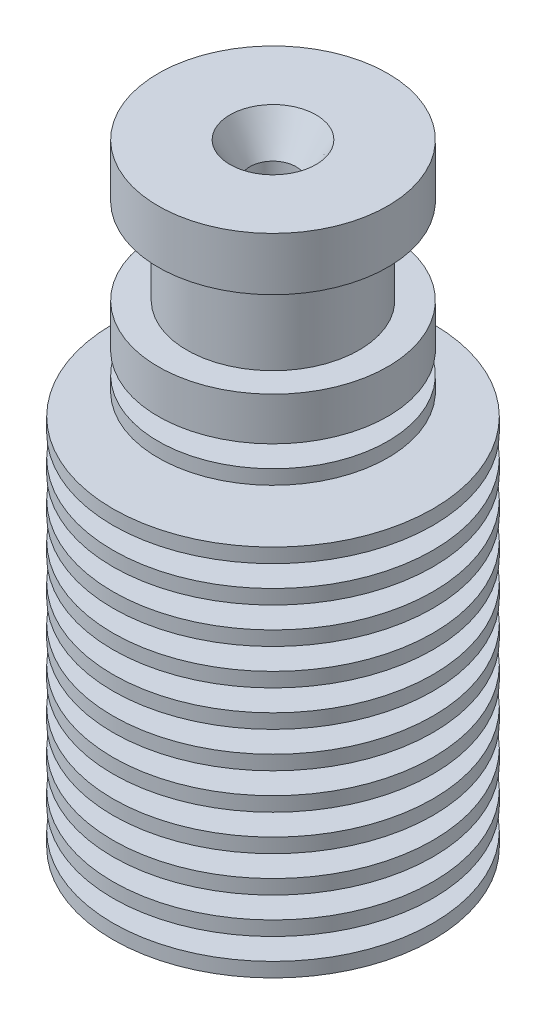
ISO-10303-21;
HEADER;
FILE_DESCRIPTION(('STEP AP214'),'2;1');
FILE_NAME('part.step','',(''),(''),'','','');
FILE_SCHEMA(('AUTOMOTIVE_DESIGN { 1 0 10303 214 1 1 1 1 }'));
ENDSEC;
DATA;
#1=APPLICATION_CONTEXT('core data for automotive mechanical design processes');
#2=APPLICATION_PROTOCOL_DEFINITION('international standard','automotive_design',2000,#1);
#3=PRODUCT_CONTEXT('',#1,'mechanical');
#4=PRODUCT('Part','Part','',(#3));
#5=PRODUCT_RELATED_PRODUCT_CATEGORY('part','',(#4));
#6=PRODUCT_DEFINITION_FORMATION('','',#4);
#7=PRODUCT_DEFINITION_CONTEXT('part definition',#1,'design');
#8=PRODUCT_DEFINITION('design','',#6,#7);
#9=PRODUCT_DEFINITION_SHAPE('','',#8);
#10=(LENGTH_UNIT() NAMED_UNIT(*) SI_UNIT(.MILLI.,.METRE.));
#11=(NAMED_UNIT(*) PLANE_ANGLE_UNIT() SI_UNIT($,.RADIAN.));
#12=(NAMED_UNIT(*) SI_UNIT($,.STERADIAN.) SOLID_ANGLE_UNIT());
#13=UNCERTAINTY_MEASURE_WITH_UNIT(LENGTH_MEASURE(1.E-05),#10,'distance_accuracy_value','');
#14=(GEOMETRIC_REPRESENTATION_CONTEXT(3) GLOBAL_UNCERTAINTY_ASSIGNED_CONTEXT((#13)) GLOBAL_UNIT_ASSIGNED_CONTEXT((#10,
#11,#12)) REPRESENTATION_CONTEXT('',''));
#15=CARTESIAN_POINT('',(0.,0.,0.));
#16=DIRECTION('',(0.,0.,1.));
#17=DIRECTION('',(1.,0.,0.));
#18=AXIS2_PLACEMENT_3D('',#15,#16,#17);
#19=CARTESIAN_POINT('',(0.,0.,0.));
#20=DIRECTION('',(0.,-1.,0.));
#21=DIRECTION('',(0.,0.,-1.));
#22=AXIS2_PLACEMENT_3D('',#19,#20,#21);
#23=CONICAL_SURFACE('',#22,6.,0.0523598775598299);
#24=CARTESIAN_POINT('',(0.,23.5,0.));
#25=DIRECTION('',(0.,1.,0.));
#26=DIRECTION('',(0.,0.,1.));
#27=AXIS2_PLACEMENT_3D('',#24,#25,#26);
#28=CIRCLE('',#27,4.76841718684853);
#29=CARTESIAN_POINT('',(0.,23.5,4.76841718684853));
#30=VERTEX_POINT('',#29);
#31=EDGE_CURVE('E217',#30,#30,#28,.F.);
#32=ORIENTED_EDGE('',*,*,#31,.F.);
#33=EDGE_LOOP('',(#32));
#34=FACE_BOUND('',#33,.T.);
#35=CARTESIAN_POINT('',(0.,25.,0.));
#36=DIRECTION('',(0.,1.,0.));
#37=DIRECTION('',(0.,0.,1.));
#38=AXIS2_PLACEMENT_3D('',#35,#36,#37);
#39=CIRCLE('',#38,4.68980551792397);
#40=CARTESIAN_POINT('',(0.,25.,4.68980551792397));
#41=VERTEX_POINT('',#40);
#42=EDGE_CURVE('E102',#41,#41,#39,.F.);
#43=ORIENTED_EDGE('',*,*,#42,.T.);
#44=EDGE_LOOP('',(#43));
#45=FACE_BOUND('',#44,.T.);
#46=ADVANCED_FACE('F48',(#34,#45),#23,.T.);
#47=CARTESIAN_POINT('',(0.,21.,0.));
#48=DIRECTION('',(0.,1.,0.));
#49=DIRECTION('',(0.,0.,1.));
#50=AXIS2_PLACEMENT_3D('',#47,#48,#49);
#51=CIRCLE('',#50,4.89943663505613);
#52=CARTESIAN_POINT('',(0.,21.,4.89943663505613));
#53=VERTEX_POINT('',#52);
#54=EDGE_CURVE('E212',#53,#53,#51,.F.);
#55=ORIENTED_EDGE('',*,*,#54,.F.);
#56=EDGE_LOOP('',(#55));
#57=FACE_BOUND('',#56,.T.);
#58=CARTESIAN_POINT('',(0.,22.5,0.));
#59=DIRECTION('',(0.,1.,0.));
#60=DIRECTION('',(0.,0.,1.));
#61=AXIS2_PLACEMENT_3D('',#58,#59,#60);
#62=CIRCLE('',#61,4.82082496613157);
#63=CARTESIAN_POINT('',(0.,22.5,4.82082496613157));
#64=VERTEX_POINT('',#63);
#65=EDGE_CURVE('E108',#64,#64,#62,.F.);
#66=ORIENTED_EDGE('',*,*,#65,.T.);
#67=EDGE_LOOP('',(#66));
#68=FACE_BOUND('',#67,.T.);
#69=ADVANCED_FACE('F255',(#57,#68),#23,.T.);
#70=CARTESIAN_POINT('',(0.,18.5,0.));
#71=DIRECTION('',(0.,1.,0.));
#72=DIRECTION('',(0.,0.,1.));
#73=AXIS2_PLACEMENT_3D('',#70,#71,#72);
#74=CIRCLE('',#73,5.03045608326374);
#75=CARTESIAN_POINT('',(0.,18.5,5.03045608326374));
#76=VERTEX_POINT('',#75);
#77=EDGE_CURVE('E207',#76,#76,#74,.F.);
#78=ORIENTED_EDGE('',*,*,#77,.F.);
#79=EDGE_LOOP('',(#78));
#80=FACE_BOUND('',#79,.T.);
#81=CARTESIAN_POINT('',(0.,20.,0.));
#82=DIRECTION('',(0.,1.,0.));
#83=DIRECTION('',(0.,0.,1.));
#84=AXIS2_PLACEMENT_3D('',#81,#82,#83);
#85=CIRCLE('',#84,4.95184441433918);
#86=CARTESIAN_POINT('',(0.,20.,4.95184441433918));
#87=VERTEX_POINT('',#86);
#88=EDGE_CURVE('E115',#87,#87,#85,.F.);
#89=ORIENTED_EDGE('',*,*,#88,.T.);
#90=EDGE_LOOP('',(#89));
#91=FACE_BOUND('',#90,.T.);
#92=ADVANCED_FACE('F260',(#80,#91),#23,.T.);
#93=CARTESIAN_POINT('',(0.,16.,0.));
#94=DIRECTION('',(0.,1.,0.));
#95=DIRECTION('',(0.,0.,1.));
#96=AXIS2_PLACEMENT_3D('',#93,#94,#95);
#97=CIRCLE('',#96,5.16147553147134);
#98=CARTESIAN_POINT('',(0.,16.,5.16147553147134));
#99=VERTEX_POINT('',#98);
#100=EDGE_CURVE('E202',#99,#99,#97,.F.);
#101=ORIENTED_EDGE('',*,*,#100,.F.);
#102=EDGE_LOOP('',(#101));
#103=FACE_BOUND('',#102,.T.);
#104=CARTESIAN_POINT('',(0.,17.5,0.));
#105=DIRECTION('',(0.,1.,0.));
#106=DIRECTION('',(0.,0.,1.));
#107=AXIS2_PLACEMENT_3D('',#104,#105,#106);
#108=CIRCLE('',#107,5.08286386254678);
#109=CARTESIAN_POINT('',(0.,17.5,5.08286386254678));
#110=VERTEX_POINT('',#109);
#111=EDGE_CURVE('E122',#110,#110,#108,.F.);
#112=ORIENTED_EDGE('',*,*,#111,.T.);
#113=EDGE_LOOP('',(#112));
#114=FACE_BOUND('',#113,.T.);
#115=ADVANCED_FACE('F565',(#103,#114),#23,.T.);
#116=CARTESIAN_POINT('',(0.,13.5,0.));
#117=DIRECTION('',(0.,1.,0.));
#118=DIRECTION('',(0.,0.,1.));
#119=AXIS2_PLACEMENT_3D('',#116,#117,#118);
#120=CIRCLE('',#119,5.29249497967894);
#121=CARTESIAN_POINT('',(0.,13.5,5.29249497967894));
#122=VERTEX_POINT('',#121);
#123=EDGE_CURVE('E197',#122,#122,#120,.F.);
#124=ORIENTED_EDGE('',*,*,#123,.F.);
#125=EDGE_LOOP('',(#124));
#126=FACE_BOUND('',#125,.T.);
#127=CARTESIAN_POINT('',(0.,15.,0.));
#128=DIRECTION('',(0.,1.,0.));
#129=DIRECTION('',(0.,0.,1.));
#130=AXIS2_PLACEMENT_3D('',#127,#128,#129);
#131=CIRCLE('',#130,5.21388331075438);
#132=CARTESIAN_POINT('',(0.,15.,5.21388331075438));
#133=VERTEX_POINT('',#132);
#134=EDGE_CURVE('E129',#133,#133,#131,.F.);
#135=ORIENTED_EDGE('',*,*,#134,.T.);
#136=EDGE_LOOP('',(#135));
#137=FACE_BOUND('',#136,.T.);
#138=ADVANCED_FACE('F557',(#126,#137),#23,.T.);
#139=CARTESIAN_POINT('',(0.,11.,0.));
#140=DIRECTION('',(0.,1.,0.));
#141=DIRECTION('',(0.,0.,1.));
#142=AXIS2_PLACEMENT_3D('',#139,#140,#141);
#143=CIRCLE('',#142,5.42351442788655);
#144=CARTESIAN_POINT('',(0.,11.,5.42351442788655));
#145=VERTEX_POINT('',#144);
#146=EDGE_CURVE('E192',#145,#145,#143,.F.);
#147=ORIENTED_EDGE('',*,*,#146,.F.);
#148=EDGE_LOOP('',(#147));
#149=FACE_BOUND('',#148,.T.);
#150=CARTESIAN_POINT('',(0.,12.5,0.));
#151=DIRECTION('',(0.,1.,0.));
#152=DIRECTION('',(0.,0.,1.));
#153=AXIS2_PLACEMENT_3D('',#150,#151,#152);
#154=CIRCLE('',#153,5.34490275896199);
#155=CARTESIAN_POINT('',(0.,12.5,5.34490275896199));
#156=VERTEX_POINT('',#155);
#157=EDGE_CURVE('E136',#156,#156,#154,.F.);
#158=ORIENTED_EDGE('',*,*,#157,.T.);
#159=EDGE_LOOP('',(#158));
#160=FACE_BOUND('',#159,.T.);
#161=ADVANCED_FACE('F549',(#149,#160),#23,.T.);
#162=CARTESIAN_POINT('',(0.,8.5,0.));
#163=DIRECTION('',(0.,1.,0.));
#164=DIRECTION('',(0.,0.,1.));
#165=AXIS2_PLACEMENT_3D('',#162,#163,#164);
#166=CIRCLE('',#165,5.55453387609415);
#167=CARTESIAN_POINT('',(0.,8.5,5.55453387609415));
#168=VERTEX_POINT('',#167);
#169=EDGE_CURVE('E187',#168,#168,#166,.F.);
#170=ORIENTED_EDGE('',*,*,#169,.F.);
#171=EDGE_LOOP('',(#170));
#172=FACE_BOUND('',#171,.T.);
#173=CARTESIAN_POINT('',(0.,10.,0.));
#174=DIRECTION('',(0.,1.,0.));
#175=DIRECTION('',(0.,0.,1.));
#176=AXIS2_PLACEMENT_3D('',#173,#174,#175);
#177=CIRCLE('',#176,5.47592220716959);
#178=CARTESIAN_POINT('',(0.,10.,5.47592220716959));
#179=VERTEX_POINT('',#178);
#180=EDGE_CURVE('E143',#179,#179,#177,.F.);
#181=ORIENTED_EDGE('',*,*,#180,.T.);
#182=EDGE_LOOP('',(#181));
#183=FACE_BOUND('',#182,.T.);
#184=ADVANCED_FACE('F541',(#172,#183),#23,.T.);
#185=CARTESIAN_POINT('',(0.,6.,0.));
#186=DIRECTION('',(0.,1.,0.));
#187=DIRECTION('',(0.,0.,1.));
#188=AXIS2_PLACEMENT_3D('',#185,#186,#187);
#189=CIRCLE('',#188,5.68555332430175);
#190=CARTESIAN_POINT('',(0.,6.,5.68555332430175));
#191=VERTEX_POINT('',#190);
#192=EDGE_CURVE('E182',#191,#191,#189,.F.);
#193=ORIENTED_EDGE('',*,*,#192,.F.);
#194=EDGE_LOOP('',(#193));
#195=FACE_BOUND('',#194,.T.);
#196=CARTESIAN_POINT('',(0.,7.5,0.));
#197=DIRECTION('',(0.,1.,0.));
#198=DIRECTION('',(0.,0.,1.));
#199=AXIS2_PLACEMENT_3D('',#196,#197,#198);
#200=CIRCLE('',#199,5.60694165537719);
#201=CARTESIAN_POINT('',(0.,7.5,5.60694165537719));
#202=VERTEX_POINT('',#201);
#203=EDGE_CURVE('E150',#202,#202,#200,.F.);
#204=ORIENTED_EDGE('',*,*,#203,.T.);
#205=EDGE_LOOP('',(#204));
#206=FACE_BOUND('',#205,.T.);
#207=ADVANCED_FACE('F533',(#195,#206),#23,.T.);
#208=CARTESIAN_POINT('',(0.,3.5,0.));
#209=DIRECTION('',(0.,1.,0.));
#210=DIRECTION('',(0.,0.,1.));
#211=AXIS2_PLACEMENT_3D('',#208,#209,#210);
#212=CIRCLE('',#211,5.81657277250936);
#213=CARTESIAN_POINT('',(0.,3.5,5.81657277250936));
#214=VERTEX_POINT('',#213);
#215=EDGE_CURVE('E171',#214,#214,#212,.F.);
#216=ORIENTED_EDGE('',*,*,#215,.F.);
#217=EDGE_LOOP('',(#216));
#218=FACE_BOUND('',#217,.T.);
#219=CARTESIAN_POINT('',(0.,5.,0.));
#220=DIRECTION('',(0.,1.,0.));
#221=DIRECTION('',(0.,0.,1.));
#222=AXIS2_PLACEMENT_3D('',#219,#220,#221);
#223=CIRCLE('',#222,5.73796110358479);
#224=CARTESIAN_POINT('',(0.,5.,5.73796110358479));
#225=VERTEX_POINT('',#224);
#226=EDGE_CURVE('E157',#225,#225,#223,.F.);
#227=ORIENTED_EDGE('',*,*,#226,.T.);
#228=EDGE_LOOP('',(#227));
#229=FACE_BOUND('',#228,.T.);
#230=ADVANCED_FACE('F252',(#218,#229),#23,.T.);
#231=CARTESIAN_POINT('',(0.,1.,0.));
#232=DIRECTION('',(0.,1.,0.));
#233=DIRECTION('',(0.,0.,1.));
#234=AXIS2_PLACEMENT_3D('',#231,#232,#233);
#235=CIRCLE('',#234,5.94759222071696);
#236=CARTESIAN_POINT('',(0.,1.,5.94759222071696));
#237=VERTEX_POINT('',#236);
#238=EDGE_CURVE('E168',#237,#237,#235,.T.);
#239=ORIENTED_EDGE('',*,*,#238,.T.);
#240=EDGE_LOOP('',(#239));
#241=FACE_BOUND('',#240,.T.);
#242=CARTESIAN_POINT('',(0.,2.5,0.));
#243=DIRECTION('',(0.,1.,0.));
#244=DIRECTION('',(0.,0.,1.));
#245=AXIS2_PLACEMENT_3D('',#242,#243,#244);
#246=CIRCLE('',#245,5.8689805517924);
#247=CARTESIAN_POINT('',(0.,2.5,5.8689805517924));
#248=VERTEX_POINT('',#247);
#249=EDGE_CURVE('E164',#248,#248,#246,.F.);
#250=ORIENTED_EDGE('',*,*,#249,.T.);
#251=EDGE_LOOP('',(#250));
#252=FACE_BOUND('',#251,.T.);
#253=ADVANCED_FACE('F236',(#241,#252),#23,.T.);
#254=CARTESIAN_POINT('',(0.,1.,0.));
#255=DIRECTION('',(0.,-1.,0.));
#256=DIRECTION('',(0.,0.,-1.));
#257=AXIS2_PLACEMENT_3D('',#254,#255,#256);
#258=CYLINDRICAL_SURFACE('',#257,11.15);
#259=CARTESIAN_POINT('',(0.,1.,0.));
#260=DIRECTION('',(0.,1.,0.));
#261=DIRECTION('',(0.,0.,1.));
#262=AXIS2_PLACEMENT_3D('',#259,#260,#261);
#263=CIRCLE('',#262,11.15);
#264=CARTESIAN_POINT('',(0.,1.,11.15));
#265=VERTEX_POINT('',#264);
#266=EDGE_CURVE('E172',#265,#265,#263,.T.);
#267=ORIENTED_EDGE('',*,*,#266,.F.);
#268=EDGE_LOOP('',(#267));
#269=FACE_BOUND('',#268,.T.);
#270=CARTESIAN_POINT('',(0.,0.,0.));
#271=DIRECTION('',(0.,1.,0.));
#272=DIRECTION('',(0.,0.,1.));
#273=AXIS2_PLACEMENT_3D('',#270,#271,#272);
#274=CIRCLE('',#273,11.15);
#275=CARTESIAN_POINT('',(0.,0.,11.15));
#276=VERTEX_POINT('',#275);
#277=EDGE_CURVE('E175',#276,#276,#274,.T.);
#278=ORIENTED_EDGE('',*,*,#277,.T.);
#279=EDGE_LOOP('',(#278));
#280=FACE_BOUND('',#279,.T.);
#281=ADVANCED_FACE('F50',(#269,#280),#258,.T.);
#282=CARTESIAN_POINT('',(0.,1.,0.));
#283=DIRECTION('',(0.,1.,0.));
#284=DIRECTION('',(0.,0.,1.));
#285=AXIS2_PLACEMENT_3D('',#282,#283,#284);
#286=PLANE('',#285);
#287=ORIENTED_EDGE('',*,*,#238,.F.);
#288=EDGE_LOOP('',(#287));
#289=FACE_BOUND('',#288,.T.);
#290=ORIENTED_EDGE('',*,*,#266,.T.);
#291=EDGE_LOOP('',(#290));
#292=FACE_BOUND('',#291,.T.);
#293=ADVANCED_FACE('F485',(#289,#292),#286,.T.);
#294=CARTESIAN_POINT('',(0.,0.,0.));
#295=DIRECTION('',(0.,1.,0.));
#296=DIRECTION('',(0.,0.,1.));
#297=AXIS2_PLACEMENT_3D('',#294,#295,#296);
#298=PLANE('',#297);
#299=CARTESIAN_POINT('',(0.,0.,0.));
#300=DIRECTION('',(0.,1.,0.));
#301=DIRECTION('',(0.,0.,1.));
#302=AXIS2_PLACEMENT_3D('',#299,#300,#301);
#303=CIRCLE('',#302,1.6);
#304=CARTESIAN_POINT('',(0.,0.,1.6));
#305=VERTEX_POINT('',#304);
#306=EDGE_CURVE('E79',#305,#305,#303,.T.);
#307=ORIENTED_EDGE('',*,*,#306,.T.);
#308=EDGE_LOOP('',(#307));
#309=FACE_BOUND('',#308,.T.);
#310=ORIENTED_EDGE('',*,*,#277,.F.);
#311=EDGE_LOOP('',(#310));
#312=FACE_BOUND('',#311,.T.);
#313=ADVANCED_FACE('F384',(#309,#312),#298,.F.);
#314=CARTESIAN_POINT('',(0.,3.5,0.));
#315=DIRECTION('',(0.,-1.,0.));
#316=DIRECTION('',(0.,0.,-1.));
#317=AXIS2_PLACEMENT_3D('',#314,#315,#316);
#318=CYLINDRICAL_SURFACE('',#317,11.15);
#319=CARTESIAN_POINT('',(0.,3.5,0.));
#320=DIRECTION('',(0.,1.,0.));
#321=DIRECTION('',(0.,0.,1.));
#322=AXIS2_PLACEMENT_3D('',#319,#320,#321);
#323=CIRCLE('',#322,11.15);
#324=CARTESIAN_POINT('',(0.,3.5,11.15));
#325=VERTEX_POINT('',#324);
#326=EDGE_CURVE('E161',#325,#325,#323,.T.);
#327=ORIENTED_EDGE('',*,*,#326,.F.);
#328=EDGE_LOOP('',(#327));
#329=FACE_BOUND('',#328,.T.);
#330=CARTESIAN_POINT('',(0.,2.5,0.));
#331=DIRECTION('',(0.,1.,0.));
#332=DIRECTION('',(0.,0.,1.));
#333=AXIS2_PLACEMENT_3D('',#330,#331,#332);
#334=CIRCLE('',#333,11.15);
#335=CARTESIAN_POINT('',(0.,2.5,11.15));
#336=VERTEX_POINT('',#335);
#337=EDGE_CURVE('E165',#336,#336,#334,.T.);
#338=ORIENTED_EDGE('',*,*,#337,.T.);
#339=EDGE_LOOP('',(#338));
#340=FACE_BOUND('',#339,.T.);
#341=ADVANCED_FACE('F378',(#329,#340),#318,.T.);
#342=CARTESIAN_POINT('',(0.,3.5,0.));
#343=DIRECTION('',(0.,1.,0.));
#344=DIRECTION('',(0.,0.,1.));
#345=AXIS2_PLACEMENT_3D('',#342,#343,#344);
#346=PLANE('',#345);
#347=ORIENTED_EDGE('',*,*,#215,.T.);
#348=EDGE_LOOP('',(#347));
#349=FACE_BOUND('',#348,.T.);
#350=ORIENTED_EDGE('',*,*,#326,.T.);
#351=EDGE_LOOP('',(#350));
#352=FACE_BOUND('',#351,.T.);
#353=ADVANCED_FACE('F375',(#349,#352),#346,.T.);
#354=CARTESIAN_POINT('',(0.,2.5,0.));
#355=DIRECTION('',(0.,1.,0.));
#356=DIRECTION('',(0.,0.,1.));
#357=AXIS2_PLACEMENT_3D('',#354,#355,#356);
#358=PLANE('',#357);
#359=ORIENTED_EDGE('',*,*,#249,.F.);
#360=EDGE_LOOP('',(#359));
#361=FACE_BOUND('',#360,.T.);
#362=ORIENTED_EDGE('',*,*,#337,.F.);
#363=EDGE_LOOP('',(#362));
#364=FACE_BOUND('',#363,.T.);
#365=ADVANCED_FACE('F373',(#361,#364),#358,.F.);
#366=CARTESIAN_POINT('',(0.,6.,0.));
#367=DIRECTION('',(0.,-1.,0.));
#368=DIRECTION('',(0.,0.,-1.));
#369=AXIS2_PLACEMENT_3D('',#366,#367,#368);
#370=CYLINDRICAL_SURFACE('',#369,11.15);
#371=CARTESIAN_POINT('',(0.,6.,0.));
#372=DIRECTION('',(0.,1.,0.));
#373=DIRECTION('',(0.,0.,1.));
#374=AXIS2_PLACEMENT_3D('',#371,#372,#373);
#375=CIRCLE('',#374,11.15);
#376=CARTESIAN_POINT('',(0.,6.,11.15));
#377=VERTEX_POINT('',#376);
#378=EDGE_CURVE('E154',#377,#377,#375,.T.);
#379=ORIENTED_EDGE('',*,*,#378,.F.);
#380=EDGE_LOOP('',(#379));
#381=FACE_BOUND('',#380,.T.);
#382=CARTESIAN_POINT('',(0.,5.,0.));
#383=DIRECTION('',(0.,1.,0.));
#384=DIRECTION('',(0.,0.,1.));
#385=AXIS2_PLACEMENT_3D('',#382,#383,#384);
#386=CIRCLE('',#385,11.15);
#387=CARTESIAN_POINT('',(0.,5.,11.15));
#388=VERTEX_POINT('',#387);
#389=EDGE_CURVE('E158',#388,#388,#386,.T.);
#390=ORIENTED_EDGE('',*,*,#389,.T.);
#391=EDGE_LOOP('',(#390));
#392=FACE_BOUND('',#391,.T.);
#393=ADVANCED_FACE('F366',(#381,#392),#370,.T.);
#394=CARTESIAN_POINT('',(0.,6.,0.));
#395=DIRECTION('',(0.,1.,0.));
#396=DIRECTION('',(0.,0.,1.));
#397=AXIS2_PLACEMENT_3D('',#394,#395,#396);
#398=PLANE('',#397);
#399=ORIENTED_EDGE('',*,*,#192,.T.);
#400=EDGE_LOOP('',(#399));
#401=FACE_BOUND('',#400,.T.);
#402=ORIENTED_EDGE('',*,*,#378,.T.);
#403=EDGE_LOOP('',(#402));
#404=FACE_BOUND('',#403,.T.);
#405=ADVANCED_FACE('F363',(#401,#404),#398,.T.);
#406=CARTESIAN_POINT('',(0.,5.,0.));
#407=DIRECTION('',(0.,1.,0.));
#408=DIRECTION('',(0.,0.,1.));
#409=AXIS2_PLACEMENT_3D('',#406,#407,#408);
#410=PLANE('',#409);
#411=ORIENTED_EDGE('',*,*,#226,.F.);
#412=EDGE_LOOP('',(#411));
#413=FACE_BOUND('',#412,.T.);
#414=ORIENTED_EDGE('',*,*,#389,.F.);
#415=EDGE_LOOP('',(#414));
#416=FACE_BOUND('',#415,.T.);
#417=ADVANCED_FACE('F361',(#413,#416),#410,.F.);
#418=CARTESIAN_POINT('',(0.,8.5,0.));
#419=DIRECTION('',(0.,-1.,0.));
#420=DIRECTION('',(0.,0.,-1.));
#421=AXIS2_PLACEMENT_3D('',#418,#419,#420);
#422=CYLINDRICAL_SURFACE('',#421,11.15);
#423=CARTESIAN_POINT('',(0.,8.5,0.));
#424=DIRECTION('',(0.,1.,0.));
#425=DIRECTION('',(0.,0.,1.));
#426=AXIS2_PLACEMENT_3D('',#423,#424,#425);
#427=CIRCLE('',#426,11.15);
#428=CARTESIAN_POINT('',(0.,8.5,11.15));
#429=VERTEX_POINT('',#428);
#430=EDGE_CURVE('E147',#429,#429,#427,.T.);
#431=ORIENTED_EDGE('',*,*,#430,.F.);
#432=EDGE_LOOP('',(#431));
#433=FACE_BOUND('',#432,.T.);
#434=CARTESIAN_POINT('',(0.,7.5,0.));
#435=DIRECTION('',(0.,1.,0.));
#436=DIRECTION('',(0.,0.,1.));
#437=AXIS2_PLACEMENT_3D('',#434,#435,#436);
#438=CIRCLE('',#437,11.15);
#439=CARTESIAN_POINT('',(0.,7.5,11.15));
#440=VERTEX_POINT('',#439);
#441=EDGE_CURVE('E151',#440,#440,#438,.T.);
#442=ORIENTED_EDGE('',*,*,#441,.T.);
#443=EDGE_LOOP('',(#442));
#444=FACE_BOUND('',#443,.T.);
#445=ADVANCED_FACE('F354',(#433,#444),#422,.T.);
#446=CARTESIAN_POINT('',(0.,8.5,0.));
#447=DIRECTION('',(0.,1.,0.));
#448=DIRECTION('',(0.,0.,1.));
#449=AXIS2_PLACEMENT_3D('',#446,#447,#448);
#450=PLANE('',#449);
#451=ORIENTED_EDGE('',*,*,#169,.T.);
#452=EDGE_LOOP('',(#451));
#453=FACE_BOUND('',#452,.T.);
#454=ORIENTED_EDGE('',*,*,#430,.T.);
#455=EDGE_LOOP('',(#454));
#456=FACE_BOUND('',#455,.T.);
#457=ADVANCED_FACE('F351',(#453,#456),#450,.T.);
#458=CARTESIAN_POINT('',(0.,7.5,0.));
#459=DIRECTION('',(0.,1.,0.));
#460=DIRECTION('',(0.,0.,1.));
#461=AXIS2_PLACEMENT_3D('',#458,#459,#460);
#462=PLANE('',#461);
#463=ORIENTED_EDGE('',*,*,#203,.F.);
#464=EDGE_LOOP('',(#463));
#465=FACE_BOUND('',#464,.T.);
#466=ORIENTED_EDGE('',*,*,#441,.F.);
#467=EDGE_LOOP('',(#466));
#468=FACE_BOUND('',#467,.T.);
#469=ADVANCED_FACE('F349',(#465,#468),#462,.F.);
#470=CARTESIAN_POINT('',(0.,11.,0.));
#471=DIRECTION('',(0.,-1.,0.));
#472=DIRECTION('',(0.,0.,-1.));
#473=AXIS2_PLACEMENT_3D('',#470,#471,#472);
#474=CYLINDRICAL_SURFACE('',#473,11.15);
#475=CARTESIAN_POINT('',(0.,11.,0.));
#476=DIRECTION('',(0.,1.,0.));
#477=DIRECTION('',(0.,0.,1.));
#478=AXIS2_PLACEMENT_3D('',#475,#476,#477);
#479=CIRCLE('',#478,11.15);
#480=CARTESIAN_POINT('',(0.,11.,11.15));
#481=VERTEX_POINT('',#480);
#482=EDGE_CURVE('E140',#481,#481,#479,.T.);
#483=ORIENTED_EDGE('',*,*,#482,.F.);
#484=EDGE_LOOP('',(#483));
#485=FACE_BOUND('',#484,.T.);
#486=CARTESIAN_POINT('',(0.,10.,0.));
#487=DIRECTION('',(0.,1.,0.));
#488=DIRECTION('',(0.,0.,1.));
#489=AXIS2_PLACEMENT_3D('',#486,#487,#488);
#490=CIRCLE('',#489,11.15);
#491=CARTESIAN_POINT('',(0.,10.,11.15));
#492=VERTEX_POINT('',#491);
#493=EDGE_CURVE('E144',#492,#492,#490,.T.);
#494=ORIENTED_EDGE('',*,*,#493,.T.);
#495=EDGE_LOOP('',(#494));
#496=FACE_BOUND('',#495,.T.);
#497=ADVANCED_FACE('F342',(#485,#496),#474,.T.);
#498=CARTESIAN_POINT('',(0.,11.,0.));
#499=DIRECTION('',(0.,1.,0.));
#500=DIRECTION('',(0.,0.,1.));
#501=AXIS2_PLACEMENT_3D('',#498,#499,#500);
#502=PLANE('',#501);
#503=ORIENTED_EDGE('',*,*,#146,.T.);
#504=EDGE_LOOP('',(#503));
#505=FACE_BOUND('',#504,.T.);
#506=ORIENTED_EDGE('',*,*,#482,.T.);
#507=EDGE_LOOP('',(#506));
#508=FACE_BOUND('',#507,.T.);
#509=ADVANCED_FACE('F339',(#505,#508),#502,.T.);
#510=CARTESIAN_POINT('',(0.,10.,0.));
#511=DIRECTION('',(0.,1.,0.));
#512=DIRECTION('',(0.,0.,1.));
#513=AXIS2_PLACEMENT_3D('',#510,#511,#512);
#514=PLANE('',#513);
#515=ORIENTED_EDGE('',*,*,#180,.F.);
#516=EDGE_LOOP('',(#515));
#517=FACE_BOUND('',#516,.T.);
#518=ORIENTED_EDGE('',*,*,#493,.F.);
#519=EDGE_LOOP('',(#518));
#520=FACE_BOUND('',#519,.T.);
#521=ADVANCED_FACE('F337',(#517,#520),#514,.F.);
#522=CARTESIAN_POINT('',(0.,13.5,0.));
#523=DIRECTION('',(0.,-1.,0.));
#524=DIRECTION('',(0.,0.,-1.));
#525=AXIS2_PLACEMENT_3D('',#522,#523,#524);
#526=CYLINDRICAL_SURFACE('',#525,11.15);
#527=CARTESIAN_POINT('',(0.,13.5,0.));
#528=DIRECTION('',(0.,1.,0.));
#529=DIRECTION('',(0.,0.,1.));
#530=AXIS2_PLACEMENT_3D('',#527,#528,#529);
#531=CIRCLE('',#530,11.15);
#532=CARTESIAN_POINT('',(0.,13.5,11.15));
#533=VERTEX_POINT('',#532);
#534=EDGE_CURVE('E133',#533,#533,#531,.T.);
#535=ORIENTED_EDGE('',*,*,#534,.F.);
#536=EDGE_LOOP('',(#535));
#537=FACE_BOUND('',#536,.T.);
#538=CARTESIAN_POINT('',(0.,12.5,0.));
#539=DIRECTION('',(0.,1.,0.));
#540=DIRECTION('',(0.,0.,1.));
#541=AXIS2_PLACEMENT_3D('',#538,#539,#540);
#542=CIRCLE('',#541,11.15);
#543=CARTESIAN_POINT('',(0.,12.5,11.15));
#544=VERTEX_POINT('',#543);
#545=EDGE_CURVE('E137',#544,#544,#542,.T.);
#546=ORIENTED_EDGE('',*,*,#545,.T.);
#547=EDGE_LOOP('',(#546));
#548=FACE_BOUND('',#547,.T.);
#549=ADVANCED_FACE('F330',(#537,#548),#526,.T.);
#550=CARTESIAN_POINT('',(0.,13.5,0.));
#551=DIRECTION('',(0.,1.,0.));
#552=DIRECTION('',(0.,0.,1.));
#553=AXIS2_PLACEMENT_3D('',#550,#551,#552);
#554=PLANE('',#553);
#555=ORIENTED_EDGE('',*,*,#123,.T.);
#556=EDGE_LOOP('',(#555));
#557=FACE_BOUND('',#556,.T.);
#558=ORIENTED_EDGE('',*,*,#534,.T.);
#559=EDGE_LOOP('',(#558));
#560=FACE_BOUND('',#559,.T.);
#561=ADVANCED_FACE('F327',(#557,#560),#554,.T.);
#562=CARTESIAN_POINT('',(0.,12.5,0.));
#563=DIRECTION('',(0.,1.,0.));
#564=DIRECTION('',(0.,0.,1.));
#565=AXIS2_PLACEMENT_3D('',#562,#563,#564);
#566=PLANE('',#565);
#567=ORIENTED_EDGE('',*,*,#157,.F.);
#568=EDGE_LOOP('',(#567));
#569=FACE_BOUND('',#568,.T.);
#570=ORIENTED_EDGE('',*,*,#545,.F.);
#571=EDGE_LOOP('',(#570));
#572=FACE_BOUND('',#571,.T.);
#573=ADVANCED_FACE('F325',(#569,#572),#566,.F.);
#574=CARTESIAN_POINT('',(0.,16.,0.));
#575=DIRECTION('',(0.,-1.,0.));
#576=DIRECTION('',(0.,0.,-1.));
#577=AXIS2_PLACEMENT_3D('',#574,#575,#576);
#578=CYLINDRICAL_SURFACE('',#577,11.15);
#579=CARTESIAN_POINT('',(0.,16.,0.));
#580=DIRECTION('',(0.,1.,0.));
#581=DIRECTION('',(0.,0.,1.));
#582=AXIS2_PLACEMENT_3D('',#579,#580,#581);
#583=CIRCLE('',#582,11.15);
#584=CARTESIAN_POINT('',(0.,16.,11.15));
#585=VERTEX_POINT('',#584);
#586=EDGE_CURVE('E126',#585,#585,#583,.T.);
#587=ORIENTED_EDGE('',*,*,#586,.F.);
#588=EDGE_LOOP('',(#587));
#589=FACE_BOUND('',#588,.T.);
#590=CARTESIAN_POINT('',(0.,15.,0.));
#591=DIRECTION('',(0.,1.,0.));
#592=DIRECTION('',(0.,0.,1.));
#593=AXIS2_PLACEMENT_3D('',#590,#591,#592);
#594=CIRCLE('',#593,11.15);
#595=CARTESIAN_POINT('',(0.,15.,11.15));
#596=VERTEX_POINT('',#595);
#597=EDGE_CURVE('E130',#596,#596,#594,.T.);
#598=ORIENTED_EDGE('',*,*,#597,.T.);
#599=EDGE_LOOP('',(#598));
#600=FACE_BOUND('',#599,.T.);
#601=ADVANCED_FACE('F318',(#589,#600),#578,.T.);
#602=CARTESIAN_POINT('',(0.,16.,0.));
#603=DIRECTION('',(0.,1.,0.));
#604=DIRECTION('',(0.,0.,1.));
#605=AXIS2_PLACEMENT_3D('',#602,#603,#604);
#606=PLANE('',#605);
#607=ORIENTED_EDGE('',*,*,#100,.T.);
#608=EDGE_LOOP('',(#607));
#609=FACE_BOUND('',#608,.T.);
#610=ORIENTED_EDGE('',*,*,#586,.T.);
#611=EDGE_LOOP('',(#610));
#612=FACE_BOUND('',#611,.T.);
#613=ADVANCED_FACE('F315',(#609,#612),#606,.T.);
#614=CARTESIAN_POINT('',(0.,15.,0.));
#615=DIRECTION('',(0.,1.,0.));
#616=DIRECTION('',(0.,0.,1.));
#617=AXIS2_PLACEMENT_3D('',#614,#615,#616);
#618=PLANE('',#617);
#619=ORIENTED_EDGE('',*,*,#134,.F.);
#620=EDGE_LOOP('',(#619));
#621=FACE_BOUND('',#620,.T.);
#622=ORIENTED_EDGE('',*,*,#597,.F.);
#623=EDGE_LOOP('',(#622));
#624=FACE_BOUND('',#623,.T.);
#625=ADVANCED_FACE('F313',(#621,#624),#618,.F.);
#626=CARTESIAN_POINT('',(0.,18.5,0.));
#627=DIRECTION('',(0.,-1.,0.));
#628=DIRECTION('',(0.,0.,-1.));
#629=AXIS2_PLACEMENT_3D('',#626,#627,#628);
#630=CYLINDRICAL_SURFACE('',#629,11.15);
#631=CARTESIAN_POINT('',(0.,18.5,0.));
#632=DIRECTION('',(0.,1.,0.));
#633=DIRECTION('',(0.,0.,1.));
#634=AXIS2_PLACEMENT_3D('',#631,#632,#633);
#635=CIRCLE('',#634,11.15);
#636=CARTESIAN_POINT('',(0.,18.5,11.15));
#637=VERTEX_POINT('',#636);
#638=EDGE_CURVE('E119',#637,#637,#635,.T.);
#639=ORIENTED_EDGE('',*,*,#638,.F.);
#640=EDGE_LOOP('',(#639));
#641=FACE_BOUND('',#640,.T.);
#642=CARTESIAN_POINT('',(0.,17.5,0.));
#643=DIRECTION('',(0.,1.,0.));
#644=DIRECTION('',(0.,0.,1.));
#645=AXIS2_PLACEMENT_3D('',#642,#643,#644);
#646=CIRCLE('',#645,11.15);
#647=CARTESIAN_POINT('',(0.,17.5,11.15));
#648=VERTEX_POINT('',#647);
#649=EDGE_CURVE('E123',#648,#648,#646,.T.);
#650=ORIENTED_EDGE('',*,*,#649,.T.);
#651=EDGE_LOOP('',(#650));
#652=FACE_BOUND('',#651,.T.);
#653=ADVANCED_FACE('F306',(#641,#652),#630,.T.);
#654=CARTESIAN_POINT('',(0.,18.5,0.));
#655=DIRECTION('',(0.,1.,0.));
#656=DIRECTION('',(0.,0.,1.));
#657=AXIS2_PLACEMENT_3D('',#654,#655,#656);
#658=PLANE('',#657);
#659=ORIENTED_EDGE('',*,*,#77,.T.);
#660=EDGE_LOOP('',(#659));
#661=FACE_BOUND('',#660,.T.);
#662=ORIENTED_EDGE('',*,*,#638,.T.);
#663=EDGE_LOOP('',(#662));
#664=FACE_BOUND('',#663,.T.);
#665=ADVANCED_FACE('F303',(#661,#664),#658,.T.);
#666=CARTESIAN_POINT('',(0.,17.5,0.));
#667=DIRECTION('',(0.,1.,0.));
#668=DIRECTION('',(0.,0.,1.));
#669=AXIS2_PLACEMENT_3D('',#666,#667,#668);
#670=PLANE('',#669);
#671=ORIENTED_EDGE('',*,*,#111,.F.);
#672=EDGE_LOOP('',(#671));
#673=FACE_BOUND('',#672,.T.);
#674=ORIENTED_EDGE('',*,*,#649,.F.);
#675=EDGE_LOOP('',(#674));
#676=FACE_BOUND('',#675,.T.);
#677=ADVANCED_FACE('F301',(#673,#676),#670,.F.);
#678=CARTESIAN_POINT('',(0.,21.,0.));
#679=DIRECTION('',(0.,-1.,0.));
#680=DIRECTION('',(0.,0.,-1.));
#681=AXIS2_PLACEMENT_3D('',#678,#679,#680);
#682=CYLINDRICAL_SURFACE('',#681,11.15);
#683=CARTESIAN_POINT('',(0.,21.,0.));
#684=DIRECTION('',(0.,1.,0.));
#685=DIRECTION('',(0.,0.,1.));
#686=AXIS2_PLACEMENT_3D('',#683,#684,#685);
#687=CIRCLE('',#686,11.15);
#688=CARTESIAN_POINT('',(0.,21.,11.15));
#689=VERTEX_POINT('',#688);
#690=EDGE_CURVE('E112',#689,#689,#687,.T.);
#691=ORIENTED_EDGE('',*,*,#690,.F.);
#692=EDGE_LOOP('',(#691));
#693=FACE_BOUND('',#692,.T.);
#694=CARTESIAN_POINT('',(0.,20.,0.));
#695=DIRECTION('',(0.,1.,0.));
#696=DIRECTION('',(0.,0.,1.));
#697=AXIS2_PLACEMENT_3D('',#694,#695,#696);
#698=CIRCLE('',#697,11.15);
#699=CARTESIAN_POINT('',(0.,20.,11.15));
#700=VERTEX_POINT('',#699);
#701=EDGE_CURVE('E116',#700,#700,#698,.T.);
#702=ORIENTED_EDGE('',*,*,#701,.T.);
#703=EDGE_LOOP('',(#702));
#704=FACE_BOUND('',#703,.T.);
#705=ADVANCED_FACE('F294',(#693,#704),#682,.T.);
#706=CARTESIAN_POINT('',(0.,21.,0.));
#707=DIRECTION('',(0.,1.,0.));
#708=DIRECTION('',(0.,0.,1.));
#709=AXIS2_PLACEMENT_3D('',#706,#707,#708);
#710=PLANE('',#709);
#711=ORIENTED_EDGE('',*,*,#54,.T.);
#712=EDGE_LOOP('',(#711));
#713=FACE_BOUND('',#712,.T.);
#714=ORIENTED_EDGE('',*,*,#690,.T.);
#715=EDGE_LOOP('',(#714));
#716=FACE_BOUND('',#715,.T.);
#717=ADVANCED_FACE('F291',(#713,#716),#710,.T.);
#718=CARTESIAN_POINT('',(0.,20.,0.));
#719=DIRECTION('',(0.,1.,0.));
#720=DIRECTION('',(0.,0.,1.));
#721=AXIS2_PLACEMENT_3D('',#718,#719,#720);
#722=PLANE('',#721);
#723=ORIENTED_EDGE('',*,*,#88,.F.);
#724=EDGE_LOOP('',(#723));
#725=FACE_BOUND('',#724,.T.);
#726=ORIENTED_EDGE('',*,*,#701,.F.);
#727=EDGE_LOOP('',(#726));
#728=FACE_BOUND('',#727,.T.);
#729=ADVANCED_FACE('F289',(#725,#728),#722,.F.);
#730=CARTESIAN_POINT('',(0.,23.5,0.));
#731=DIRECTION('',(0.,-1.,0.));
#732=DIRECTION('',(0.,0.,-1.));
#733=AXIS2_PLACEMENT_3D('',#730,#731,#732);
#734=CYLINDRICAL_SURFACE('',#733,11.15);
#735=CARTESIAN_POINT('',(0.,23.5,0.));
#736=DIRECTION('',(0.,1.,0.));
#737=DIRECTION('',(0.,0.,1.));
#738=AXIS2_PLACEMENT_3D('',#735,#736,#737);
#739=CIRCLE('',#738,11.15);
#740=CARTESIAN_POINT('',(0.,23.5,11.15));
#741=VERTEX_POINT('',#740);
#742=EDGE_CURVE('E105',#741,#741,#739,.T.);
#743=ORIENTED_EDGE('',*,*,#742,.F.);
#744=EDGE_LOOP('',(#743));
#745=FACE_BOUND('',#744,.T.);
#746=CARTESIAN_POINT('',(0.,22.5,0.));
#747=DIRECTION('',(0.,1.,0.));
#748=DIRECTION('',(0.,0.,1.));
#749=AXIS2_PLACEMENT_3D('',#746,#747,#748);
#750=CIRCLE('',#749,11.15);
#751=CARTESIAN_POINT('',(0.,22.5,11.15));
#752=VERTEX_POINT('',#751);
#753=EDGE_CURVE('E109',#752,#752,#750,.T.);
#754=ORIENTED_EDGE('',*,*,#753,.T.);
#755=EDGE_LOOP('',(#754));
#756=FACE_BOUND('',#755,.T.);
#757=ADVANCED_FACE('F284',(#745,#756),#734,.T.);
#758=CARTESIAN_POINT('',(0.,23.5,0.));
#759=DIRECTION('',(0.,1.,0.));
#760=DIRECTION('',(0.,0.,1.));
#761=AXIS2_PLACEMENT_3D('',#758,#759,#760);
#762=PLANE('',#761);
#763=ORIENTED_EDGE('',*,*,#31,.T.);
#764=EDGE_LOOP('',(#763));
#765=FACE_BOUND('',#764,.T.);
#766=ORIENTED_EDGE('',*,*,#742,.T.);
#767=EDGE_LOOP('',(#766));
#768=FACE_BOUND('',#767,.T.);
#769=ADVANCED_FACE('F278',(#765,#768),#762,.T.);
#770=CARTESIAN_POINT('',(0.,22.5,0.));
#771=DIRECTION('',(0.,1.,0.));
#772=DIRECTION('',(0.,0.,1.));
#773=AXIS2_PLACEMENT_3D('',#770,#771,#772);
#774=PLANE('',#773);
#775=ORIENTED_EDGE('',*,*,#65,.F.);
#776=EDGE_LOOP('',(#775));
#777=FACE_BOUND('',#776,.T.);
#778=ORIENTED_EDGE('',*,*,#753,.F.);
#779=EDGE_LOOP('',(#778));
#780=FACE_BOUND('',#779,.T.);
#781=ADVANCED_FACE('F270',(#777,#780),#774,.F.);
#782=CARTESIAN_POINT('',(0.,26.,0.));
#783=DIRECTION('',(0.,-1.,0.));
#784=DIRECTION('',(0.,0.,-1.));
#785=AXIS2_PLACEMENT_3D('',#782,#783,#784);
#786=CYLINDRICAL_SURFACE('',#785,11.15);
#787=CARTESIAN_POINT('',(0.,26.,0.));
#788=DIRECTION('',(0.,1.,0.));
#789=DIRECTION('',(0.,0.,1.));
#790=AXIS2_PLACEMENT_3D('',#787,#788,#789);
#791=CIRCLE('',#790,11.15);
#792=CARTESIAN_POINT('',(0.,26.,11.15));
#793=VERTEX_POINT('',#792);
#794=EDGE_CURVE('E99',#793,#793,#791,.T.);
#795=ORIENTED_EDGE('',*,*,#794,.F.);
#796=EDGE_LOOP('',(#795));
#797=FACE_BOUND('',#796,.T.);
#798=CARTESIAN_POINT('',(0.,25.,0.));
#799=DIRECTION('',(0.,1.,0.));
#800=DIRECTION('',(0.,0.,1.));
#801=AXIS2_PLACEMENT_3D('',#798,#799,#800);
#802=CIRCLE('',#801,11.15);
#803=CARTESIAN_POINT('',(0.,25.,11.15));
#804=VERTEX_POINT('',#803);
#805=EDGE_CURVE('E96',#804,#804,#802,.T.);
#806=ORIENTED_EDGE('',*,*,#805,.T.);
#807=EDGE_LOOP('',(#806));
#808=FACE_BOUND('',#807,.T.);
#809=ADVANCED_FACE('F268',(#797,#808),#786,.T.);
#810=CARTESIAN_POINT('',(0.,26.,0.));
#811=DIRECTION('',(0.,1.,0.));
#812=DIRECTION('',(0.,0.,1.));
#813=AXIS2_PLACEMENT_3D('',#810,#811,#812);
#814=PLANE('',#813);
#815=CARTESIAN_POINT('',(0.,26.,0.));
#816=DIRECTION('',(0.,1.,0.));
#817=DIRECTION('',(0.,0.,1.));
#818=AXIS2_PLACEMENT_3D('',#815,#816,#817);
#819=CIRCLE('',#818,4.63739773864093);
#820=CARTESIAN_POINT('',(0.,26.,4.63739773864093));
#821=VERTEX_POINT('',#820);
#822=EDGE_CURVE('E61',#821,#821,#819,.F.);
#823=ORIENTED_EDGE('',*,*,#822,.T.);
#824=EDGE_LOOP('',(#823));
#825=FACE_BOUND('',#824,.T.);
#826=ORIENTED_EDGE('',*,*,#794,.T.);
#827=EDGE_LOOP('',(#826));
#828=FACE_BOUND('',#827,.T.);
#829=ADVANCED_FACE('F226',(#825,#828),#814,.T.);
#830=CARTESIAN_POINT('',(0.,25.,0.));
#831=DIRECTION('',(0.,1.,0.));
#832=DIRECTION('',(0.,0.,1.));
#833=AXIS2_PLACEMENT_3D('',#830,#831,#832);
#834=PLANE('',#833);
#835=ORIENTED_EDGE('',*,*,#42,.F.);
#836=EDGE_LOOP('',(#835));
#837=FACE_BOUND('',#836,.T.);
#838=ORIENTED_EDGE('',*,*,#805,.F.);
#839=EDGE_LOOP('',(#838));
#840=FACE_BOUND('',#839,.T.);
#841=ADVANCED_FACE('F232',(#837,#840),#834,.F.);
#842=CARTESIAN_POINT('',(0.,27.5,0.));
#843=DIRECTION('',(0.,-1.,0.));
#844=DIRECTION('',(0.,0.,-1.));
#845=AXIS2_PLACEMENT_3D('',#842,#843,#844);
#846=CIRCLE('',#845,4.55878606971637);
#847=CARTESIAN_POINT('',(0.,27.5,-4.55878606971637));
#848=VERTEX_POINT('',#847);
#849=EDGE_CURVE('E11',#848,#848,#846,.F.);
#850=ORIENTED_EDGE('',*,*,#849,.F.);
#851=EDGE_LOOP('',(#850));
#852=FACE_BOUND('',#851,.T.);
#853=ORIENTED_EDGE('',*,*,#822,.F.);
#854=EDGE_LOOP('',(#853));
#855=FACE_BOUND('',#854,.T.);
#856=ADVANCED_FACE('F229',(#852,#855),#23,.T.);
#857=CARTESIAN_POINT('',(0.,28.5,0.));
#858=DIRECTION('',(0.,-1.,0.));
#859=DIRECTION('',(0.,0.,-1.));
#860=AXIS2_PLACEMENT_3D('',#857,#858,#859);
#861=CYLINDRICAL_SURFACE('',#860,8.);
#862=CARTESIAN_POINT('',(0.,28.5,0.));
#863=DIRECTION('',(0.,-1.,0.));
#864=DIRECTION('',(0.,0.,-1.));
#865=AXIS2_PLACEMENT_3D('',#862,#863,#864);
#866=CIRCLE('',#865,8.);
#867=CARTESIAN_POINT('',(0.,28.5,-8.));
#868=VERTEX_POINT('',#867);
#869=EDGE_CURVE('E67',#868,#868,#866,.T.);
#870=ORIENTED_EDGE('',*,*,#869,.T.);
#871=EDGE_LOOP('',(#870));
#872=FACE_BOUND('',#871,.T.);
#873=CARTESIAN_POINT('',(0.,27.5,0.));
#874=DIRECTION('',(0.,-1.,0.));
#875=DIRECTION('',(0.,0.,-1.));
#876=AXIS2_PLACEMENT_3D('',#873,#874,#875);
#877=CIRCLE('',#876,8.);
#878=CARTESIAN_POINT('',(0.,27.5,-8.));
#879=VERTEX_POINT('',#878);
#880=EDGE_CURVE('E74',#879,#879,#877,.T.);
#881=ORIENTED_EDGE('',*,*,#880,.F.);
#882=EDGE_LOOP('',(#881));
#883=FACE_BOUND('',#882,.T.);
#884=ADVANCED_FACE('F231',(#872,#883),#861,.T.);
#885=CARTESIAN_POINT('',(0.,28.5,0.));
#886=DIRECTION('',(0.,-1.,0.));
#887=DIRECTION('',(0.,0.,-1.));
#888=AXIS2_PLACEMENT_3D('',#885,#886,#887);
#889=PLANE('',#888);
#890=CARTESIAN_POINT('',(0.,28.5,0.));
#891=DIRECTION('',(0.,-1.,0.));
#892=DIRECTION('',(0.,0.,-1.));
#893=AXIS2_PLACEMENT_3D('',#890,#891,#892);
#894=CIRCLE('',#893,4.50637829043333);
#895=CARTESIAN_POINT('',(0.,28.5,-4.50637829043333));
#896=VERTEX_POINT('',#895);
#897=EDGE_CURVE('E64',#896,#896,#894,.F.);
#898=ORIENTED_EDGE('',*,*,#897,.F.);
#899=EDGE_LOOP('',(#898));
#900=FACE_BOUND('',#899,.T.);
#901=ORIENTED_EDGE('',*,*,#869,.F.);
#902=EDGE_LOOP('',(#901));
#903=FACE_BOUND('',#902,.T.);
#904=ADVANCED_FACE('F241',(#900,#903),#889,.F.);
#905=CARTESIAN_POINT('',(0.,27.5,0.));
#906=DIRECTION('',(0.,-1.,0.));
#907=DIRECTION('',(0.,0.,-1.));
#908=AXIS2_PLACEMENT_3D('',#905,#906,#907);
#909=PLANE('',#908);
#910=ORIENTED_EDGE('',*,*,#849,.T.);
#911=EDGE_LOOP('',(#910));
#912=FACE_BOUND('',#911,.T.);
#913=ORIENTED_EDGE('',*,*,#880,.T.);
#914=EDGE_LOOP('',(#913));
#915=FACE_BOUND('',#914,.T.);
#916=ADVANCED_FACE('F389',(#912,#915),#909,.T.);
#917=CARTESIAN_POINT('',(0.,42.7,0.));
#918=DIRECTION('',(0.,-1.,0.));
#919=DIRECTION('',(0.,0.,-1.));
#920=AXIS2_PLACEMENT_3D('',#917,#918,#919);
#921=PLANE('',#920);
#922=CARTESIAN_POINT('',(0.,42.7,0.));
#923=DIRECTION('',(0.,1.,0.));
#924=DIRECTION('',(0.,0.,1.));
#925=AXIS2_PLACEMENT_3D('',#922,#923,#924);
#926=CIRCLE('',#925,3.);
#927=CARTESIAN_POINT('',(0.,42.7,3.));
#928=VERTEX_POINT('',#927);
#929=EDGE_CURVE('E402',#928,#928,#926,.T.);
#930=ORIENTED_EDGE('',*,*,#929,.F.);
#931=EDGE_LOOP('',(#930));
#932=FACE_BOUND('',#931,.T.);
#933=CARTESIAN_POINT('',(0.,42.7,0.));
#934=DIRECTION('',(0.,-1.,0.));
#935=DIRECTION('',(0.,0.,-1.));
#936=AXIS2_PLACEMENT_3D('',#933,#934,#935);
#937=CIRCLE('',#936,8.);
#938=CARTESIAN_POINT('',(0.,42.7,-8.));
#939=VERTEX_POINT('',#938);
#940=EDGE_CURVE('E90',#939,#939,#937,.T.);
#941=ORIENTED_EDGE('',*,*,#940,.F.);
#942=EDGE_LOOP('',(#941));
#943=FACE_BOUND('',#942,.T.);
#944=ADVANCED_FACE('F386',(#932,#943),#921,.F.);
#945=CARTESIAN_POINT('',(0.,39.,0.));
#946=DIRECTION('',(0.,1.,0.));
#947=DIRECTION('',(0.,0.,1.));
#948=AXIS2_PLACEMENT_3D('',#945,#946,#947);
#949=CYLINDRICAL_SURFACE('',#948,8.);
#950=CARTESIAN_POINT('',(0.,39.,0.));
#951=DIRECTION('',(0.,-1.,0.));
#952=DIRECTION('',(0.,0.,-1.));
#953=AXIS2_PLACEMENT_3D('',#950,#951,#952);
#954=CIRCLE('',#953,8.);
#955=CARTESIAN_POINT('',(0.,39.,-8.));
#956=VERTEX_POINT('',#955);
#957=EDGE_CURVE('E93',#956,#956,#954,.T.);
#958=ORIENTED_EDGE('',*,*,#957,.F.);
#959=EDGE_LOOP('',(#958));
#960=FACE_BOUND('',#959,.T.);
#961=ORIENTED_EDGE('',*,*,#940,.T.);
#962=EDGE_LOOP('',(#961));
#963=FACE_BOUND('',#962,.T.);
#964=ADVANCED_FACE('F388',(#960,#963),#949,.T.);
#965=CARTESIAN_POINT('',(0.,39.,0.));
#966=DIRECTION('',(0.,-1.,0.));
#967=DIRECTION('',(0.,0.,-1.));
#968=AXIS2_PLACEMENT_3D('',#965,#966,#967);
#969=PLANE('',#968);
#970=ORIENTED_EDGE('',*,*,#957,.T.);
#971=EDGE_LOOP('',(#970));
#972=FACE_BOUND('',#971,.T.);
#973=CARTESIAN_POINT('',(0.,39.,0.));
#974=DIRECTION('',(0.,-1.,0.));
#975=DIRECTION('',(0.,0.,-1.));
#976=AXIS2_PLACEMENT_3D('',#973,#974,#975);
#977=CIRCLE('',#976,6.);
#978=CARTESIAN_POINT('',(0.,39.,-6.));
#979=VERTEX_POINT('',#978);
#980=EDGE_CURVE('E85',#979,#979,#977,.T.);
#981=ORIENTED_EDGE('',*,*,#980,.F.);
#982=EDGE_LOOP('',(#981));
#983=FACE_BOUND('',#982,.T.);
#984=ADVANCED_FACE('F395',(#972,#983),#969,.T.);
#985=CARTESIAN_POINT('',(0.,33.,0.));
#986=DIRECTION('',(0.,1.,0.));
#987=DIRECTION('',(0.,0.,1.));
#988=AXIS2_PLACEMENT_3D('',#985,#986,#987);
#989=CYLINDRICAL_SURFACE('',#988,6.);
#990=CARTESIAN_POINT('',(0.,33.,0.));
#991=DIRECTION('',(0.,-1.,0.));
#992=DIRECTION('',(0.,0.,-1.));
#993=AXIS2_PLACEMENT_3D('',#990,#991,#992);
#994=CIRCLE('',#993,6.);
#995=CARTESIAN_POINT('',(0.,33.,-6.));
#996=VERTEX_POINT('',#995);
#997=EDGE_CURVE('E87',#996,#996,#994,.T.);
#998=ORIENTED_EDGE('',*,*,#997,.F.);
#999=EDGE_LOOP('',(#998));
#1000=FACE_BOUND('',#999,.T.);
#1001=ORIENTED_EDGE('',*,*,#980,.T.);
#1002=EDGE_LOOP('',(#1001));
#1003=FACE_BOUND('',#1002,.T.);
#1004=ADVANCED_FACE('F432',(#1000,#1003),#989,.T.);
#1005=CARTESIAN_POINT('',(0.,33.,0.));
#1006=DIRECTION('',(0.,-1.,0.));
#1007=DIRECTION('',(0.,0.,-1.));
#1008=AXIS2_PLACEMENT_3D('',#1005,#1006,#1007);
#1009=PLANE('',#1008);
#1010=CARTESIAN_POINT('',(0.,33.,0.));
#1011=DIRECTION('',(0.,-1.,0.));
#1012=DIRECTION('',(0.,0.,-1.));
#1013=AXIS2_PLACEMENT_3D('',#1010,#1011,#1012);
#1014=CIRCLE('',#1013,8.);
#1015=CARTESIAN_POINT('',(0.,33.,-8.));
#1016=VERTEX_POINT('',#1015);
#1017=EDGE_CURVE('E66',#1016,#1016,#1014,.T.);
#1018=ORIENTED_EDGE('',*,*,#1017,.F.);
#1019=EDGE_LOOP('',(#1018));
#1020=FACE_BOUND('',#1019,.T.);
#1021=ORIENTED_EDGE('',*,*,#997,.T.);
#1022=EDGE_LOOP('',(#1021));
#1023=FACE_BOUND('',#1022,.T.);
#1024=ADVANCED_FACE('F429',(#1020,#1023),#1009,.F.);
#1025=CARTESIAN_POINT('',(0.,30.,0.));
#1026=DIRECTION('',(0.,1.,0.));
#1027=DIRECTION('',(0.,0.,1.));
#1028=AXIS2_PLACEMENT_3D('',#1025,#1026,#1027);
#1029=CYLINDRICAL_SURFACE('',#1028,8.);
#1030=CARTESIAN_POINT('',(0.,30.,0.));
#1031=DIRECTION('',(0.,-1.,0.));
#1032=DIRECTION('',(0.,0.,-1.));
#1033=AXIS2_PLACEMENT_3D('',#1030,#1031,#1032);
#1034=CIRCLE('',#1033,8.);
#1035=CARTESIAN_POINT('',(0.,30.,-8.));
#1036=VERTEX_POINT('',#1035);
#1037=EDGE_CURVE('E71',#1036,#1036,#1034,.T.);
#1038=ORIENTED_EDGE('',*,*,#1037,.F.);
#1039=EDGE_LOOP('',(#1038));
#1040=FACE_BOUND('',#1039,.T.);
#1041=ORIENTED_EDGE('',*,*,#1017,.T.);
#1042=EDGE_LOOP('',(#1041));
#1043=FACE_BOUND('',#1042,.T.);
#1044=ADVANCED_FACE('F427',(#1040,#1043),#1029,.T.);
#1045=CARTESIAN_POINT('',(0.,30.,0.));
#1046=DIRECTION('',(0.,-1.,0.));
#1047=DIRECTION('',(0.,0.,-1.));
#1048=AXIS2_PLACEMENT_3D('',#1045,#1046,#1047);
#1049=PLANE('',#1048);
#1050=CARTESIAN_POINT('',(0.,30.,0.));
#1051=DIRECTION('',(0.,-1.,0.));
#1052=DIRECTION('',(0.,0.,-1.));
#1053=AXIS2_PLACEMENT_3D('',#1050,#1051,#1052);
#1054=CIRCLE('',#1053,4.42776662150876);
#1055=CARTESIAN_POINT('',(0.,30.,-4.42776662150876));
#1056=VERTEX_POINT('',#1055);
#1057=EDGE_CURVE('E56',#1056,#1056,#1054,.F.);
#1058=ORIENTED_EDGE('',*,*,#1057,.T.);
#1059=EDGE_LOOP('',(#1058));
#1060=FACE_BOUND('',#1059,.T.);
#1061=ORIENTED_EDGE('',*,*,#1037,.T.);
#1062=EDGE_LOOP('',(#1061));
#1063=FACE_BOUND('',#1062,.T.);
#1064=ADVANCED_FACE('F249',(#1060,#1063),#1049,.T.);
#1065=ORIENTED_EDGE('',*,*,#1057,.F.);
#1066=EDGE_LOOP('',(#1065));
#1067=FACE_BOUND('',#1066,.T.);
#1068=ORIENTED_EDGE('',*,*,#897,.T.);
#1069=EDGE_LOOP('',(#1068));
#1070=FACE_BOUND('',#1069,.T.);
#1071=ADVANCED_FACE('F235',(#1067,#1070),#23,.T.);
#1072=CARTESIAN_POINT('',(0.,0.,0.));
#1073=DIRECTION('',(0.,1.,0.));
#1074=DIRECTION('',(0.,0.,1.));
#1075=AXIS2_PLACEMENT_3D('',#1072,#1073,#1074);
#1076=CYLINDRICAL_SURFACE('',#1075,1.6);
#1077=CARTESIAN_POINT('',(0.,40.2751288694036,0.));
#1078=DIRECTION('',(0.,1.,0.));
#1079=DIRECTION('',(0.,0.,1.));
#1080=AXIS2_PLACEMENT_3D('',#1077,#1078,#1079);
#1081=CIRCLE('',#1080,1.6);
#1082=CARTESIAN_POINT('',(0.,40.2751288694036,1.6));
#1083=VERTEX_POINT('',#1082);
#1084=EDGE_CURVE('E52',#1083,#1083,#1081,.T.);
#1085=CARTESIAN_POINT('',(0.,40.2751288694036,1.6));
#1086=CARTESIAN_POINT('',(0.,39.855596277014,1.6));
#1087=CARTESIAN_POINT('',(0.,39.4360636846243,1.6));
#1088=CARTESIAN_POINT('',(0.,38.5969984998451,1.6));
#1089=CARTESIAN_POINT('',(0.,38.1774659074555,1.6));
#1090=CARTESIAN_POINT('',(0.,37.3384007226762,1.6));
#1091=CARTESIAN_POINT('',(0.,36.9188681302866,1.6));
#1092=CARTESIAN_POINT('',(0.,36.0798029455074,1.6));
#1093=CARTESIAN_POINT('',(0.,35.6602703531178,1.6));
#1094=CARTESIAN_POINT('',(0.,34.8212051683385,1.6));
#1095=CARTESIAN_POINT('',(0.,34.4016725759489,1.6));
#1096=CARTESIAN_POINT('',(0.,33.5626073911696,1.6));
#1097=CARTESIAN_POINT('',(0.,33.14307479878,1.6));
#1098=CARTESIAN_POINT('',(0.,32.3040096140008,1.6));
#1099=CARTESIAN_POINT('',(0.,31.8844770216112,1.6));
#1100=CARTESIAN_POINT('',(0.,31.0454118368319,1.6));
#1101=CARTESIAN_POINT('',(0.,30.6258792444423,1.6));
#1102=CARTESIAN_POINT('',(0.,29.7868140596631,1.6));
#1103=CARTESIAN_POINT('',(0.,29.3672814672734,1.6));
#1104=CARTESIAN_POINT('',(0.,28.5282162824942,1.6));
#1105=CARTESIAN_POINT('',(0.,28.1086836901046,1.6));
#1106=CARTESIAN_POINT('',(0.,27.2696185053253,1.6));
#1107=CARTESIAN_POINT('',(0.,26.8500859129357,1.6));
#1108=CARTESIAN_POINT('',(0.,26.0110207281565,1.6));
#1109=CARTESIAN_POINT('',(0.,25.5914881357669,1.6));
#1110=CARTESIAN_POINT('',(0.,24.7524229509876,1.6));
#1111=CARTESIAN_POINT('',(0.,24.332890358598,1.6));
#1112=CARTESIAN_POINT('',(0.,23.4938251738188,1.6));
#1113=CARTESIAN_POINT('',(0.,23.0742925814291,1.6));
#1114=CARTESIAN_POINT('',(0.,22.2352273966499,1.6));
#1115=CARTESIAN_POINT('',(0.,21.8156948042603,1.6));
#1116=CARTESIAN_POINT('',(0.,20.976629619481,1.6));
#1117=CARTESIAN_POINT('',(0.,20.5570970270914,1.6));
#1118=CARTESIAN_POINT('',(0.,19.7180318423122,1.6));
#1119=CARTESIAN_POINT('',(0.,19.2984992499225,1.6));
#1120=CARTESIAN_POINT('',(0.,18.4594340651433,1.6));
#1121=CARTESIAN_POINT('',(0.,18.0399014727537,1.6));
#1122=CARTESIAN_POINT('',(0.,17.2008362879744,1.6));
#1123=CARTESIAN_POINT('',(0.,16.7813036955848,1.6));
#1124=CARTESIAN_POINT('',(0.,15.9422385108056,1.6));
#1125=CARTESIAN_POINT('',(0.,15.522705918416,1.6));
#1126=CARTESIAN_POINT('',(0.,14.6836407336367,1.6));
#1127=CARTESIAN_POINT('',(0.,14.2641081412471,1.6));
#1128=CARTESIAN_POINT('',(0.,13.4250429564679,1.6));
#1129=CARTESIAN_POINT('',(0.,13.0055103640782,1.6));
#1130=CARTESIAN_POINT('',(0.,12.166445179299,1.6));
#1131=CARTESIAN_POINT('',(0.,11.7469125869094,1.6));
#1132=CARTESIAN_POINT('',(0.,10.9078474021301,1.6));
#1133=CARTESIAN_POINT('',(0.,10.4883148097405,1.6));
#1134=CARTESIAN_POINT('',(0.,9.64924962496127,1.6));
#1135=CARTESIAN_POINT('',(0.,9.22971703257165,1.6));
#1136=CARTESIAN_POINT('',(0.,8.39065184779241,1.6));
#1137=CARTESIAN_POINT('',(0.,7.97111925540279,1.6));
#1138=CARTESIAN_POINT('',(0.,7.13205407062355,1.6));
#1139=CARTESIAN_POINT('',(0.,6.71252147823393,1.6));
#1140=CARTESIAN_POINT('',(0.,5.87345629345469,1.6));
#1141=CARTESIAN_POINT('',(0.,5.45392370106507,1.6));
#1142=CARTESIAN_POINT('',(0.,4.61485851628583,1.6));
#1143=CARTESIAN_POINT('',(0.,4.19532592389621,1.6));
#1144=CARTESIAN_POINT('',(0.,3.35626073911696,1.6));
#1145=CARTESIAN_POINT('',(0.,2.93672814672734,1.6));
#1146=CARTESIAN_POINT('',(0.,2.0976629619481,1.6));
#1147=CARTESIAN_POINT('',(0.,1.67813036955848,1.6));
#1148=CARTESIAN_POINT('',(0.,0.839065184779243,1.6));
#1149=CARTESIAN_POINT('',(0.,0.419532592389621,1.6));
#1150=CARTESIAN_POINT('',(0.,0.,1.6));
#1151=B_SPLINE_CURVE_WITH_KNOTS('',3,(#1085,#1086,#1087,#1088,#1089,#1090,#1091,#1092,#1093,
#1094,#1095,#1096,#1097,#1098,#1099,#1100,#1101,#1102,#1103,#1104,#1105,#1106,#1107,#1108,#1109,
#1110,#1111,#1112,#1113,#1114,#1115,#1116,#1117,#1118,#1119,#1120,#1121,#1122,#1123,#1124,#1125,
#1126,#1127,#1128,#1129,#1130,#1131,#1132,#1133,#1134,#1135,#1136,#1137,#1138,#1139,#1140,#1141,
#1142,#1143,#1144,#1145,#1146,#1147,#1148,#1149,#1150),.UNSPECIFIED.,.F.,.F.,(4,2,2,2,2,2,2,2,2,
2,2,2,2,2,2,2,2,2,2,2,2,2,2,2,2,2,2,2,2,2,2,2,4),(0.,1.25859777716886,2.51719555433772,
3.77579333150659,5.03439110867545,6.29298888584431,7.55158666301317,8.81018444018204,
10.0687822173509,11.3273799945198,12.5859777716886,13.8445755488575,15.1031733260263,
16.3617711031952,17.6203688803641,18.8789666575329,20.1375644347018,21.3961622118706,
22.6547599890395,23.9133577662084,25.1719555433772,26.4305533205461,27.689151097715,
28.9477488748838,30.2063466520527,31.4649444292215,32.7235422063904,33.9821399835593,
35.2407377607281,36.499335537897,37.7579333150659,39.0165310922347,40.2751288694036),.UNSPECIFIED.);
#1152=EDGE_CURVE('BSEAM248',#1083,#305,#1151,.T.);
#1153=ORIENTED_EDGE('',*,*,#1084,.T.);
#1154=ORIENTED_EDGE('',*,*,#306,.F.);
#1155=ORIENTED_EDGE('',*,*,#1152,.T.);
#1156=ORIENTED_EDGE('',*,*,#1152,.F.);
#1157=EDGE_LOOP('',(#1153,#1155,#1154,#1156));
#1158=FACE_BOUND('',#1157,.T.);
#1159=ADVANCED_FACE('F248',(#1158),#1076,.F.);
#1160=CARTESIAN_POINT('',(0.,42.7,0.));
#1161=DIRECTION('',(0.,1.,0.));
#1162=DIRECTION('',(0.,0.,1.));
#1163=AXIS2_PLACEMENT_3D('',#1160,#1161,#1162);
#1164=CONICAL_SURFACE('',#1163,3.,0.5235987755983);
#1165=ORIENTED_EDGE('',*,*,#929,.T.);
#1166=EDGE_LOOP('',(#1165));
#1167=FACE_BOUND('',#1166,.T.);
#1168=ORIENTED_EDGE('',*,*,#1084,.F.);
#1169=EDGE_LOOP('',(#1168));
#1170=FACE_BOUND('',#1169,.T.);
#1171=ADVANCED_FACE('F415',(#1167,#1170),#1164,.F.);
#1172=CLOSED_SHELL('',(#46,#69,#92,#115,#138,#161,#184,#207,#230,#253,#281,#293,#313,#341,#353,
#365,#393,#405,#417,#445,#457,#469,#497,#509,#521,#549,#561,#573,#601,#613,#625,#653,#665,#677,
#705,#717,#729,#757,#769,#781,#809,#829,#841,#856,#884,#904,#916,#944,#964,#984,#1004,#1024,
#1044,#1064,#1071,#1159,#1171));
#1173=MANIFOLD_SOLID_BREP('B2',#1172);
#1174=ADVANCED_BREP_SHAPE_REPRESENTATION('',(#18,#1173),#14);
#1175=SHAPE_DEFINITION_REPRESENTATION(#9,#1174);
ENDSEC;
END-ISO-10303-21;
